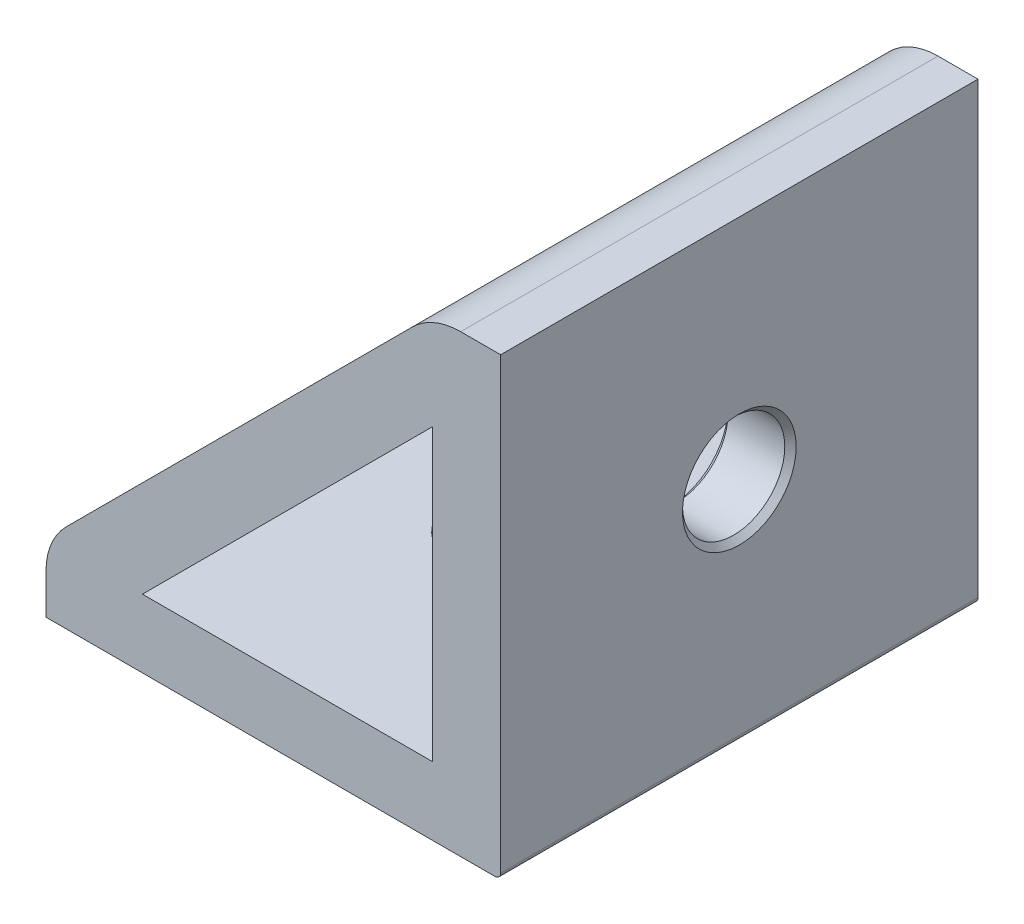
ISO-10303-21;
HEADER;
FILE_DESCRIPTION(('STEP AP214'),'2;1');
FILE_NAME('part.step','',(''),(''),'','','');
FILE_SCHEMA(('AUTOMOTIVE_DESIGN { 1 0 10303 214 1 1 1 1 }'));
ENDSEC;
DATA;
#1=APPLICATION_CONTEXT('core data for automotive mechanical design processes');
#2=APPLICATION_PROTOCOL_DEFINITION('international standard','automotive_design',2000,#1);
#3=PRODUCT_CONTEXT('',#1,'mechanical');
#4=PRODUCT('Part','Part','',(#3));
#5=PRODUCT_RELATED_PRODUCT_CATEGORY('part','',(#4));
#6=PRODUCT_DEFINITION_FORMATION('','',#4);
#7=PRODUCT_DEFINITION_CONTEXT('part definition',#1,'design');
#8=PRODUCT_DEFINITION('design','',#6,#7);
#9=PRODUCT_DEFINITION_SHAPE('','',#8);
#10=(LENGTH_UNIT() NAMED_UNIT(*) SI_UNIT(.MILLI.,.METRE.));
#11=(NAMED_UNIT(*) PLANE_ANGLE_UNIT() SI_UNIT($,.RADIAN.));
#12=(NAMED_UNIT(*) SI_UNIT($,.STERADIAN.) SOLID_ANGLE_UNIT());
#13=UNCERTAINTY_MEASURE_WITH_UNIT(LENGTH_MEASURE(1.E-05),#10,'distance_accuracy_value','');
#14=(GEOMETRIC_REPRESENTATION_CONTEXT(3) GLOBAL_UNCERTAINTY_ASSIGNED_CONTEXT((#13)) GLOBAL_UNIT_ASSIGNED_CONTEXT((#10,
#11,#12)) REPRESENTATION_CONTEXT('',''));
#15=CARTESIAN_POINT('',(0.,0.,0.));
#16=DIRECTION('',(0.,0.,1.));
#17=DIRECTION('',(1.,0.,0.));
#18=AXIS2_PLACEMENT_3D('',#15,#16,#17);
#19=CARTESIAN_POINT('',(-40.,0.,-42.));
#20=DIRECTION('',(0.,-1.,0.));
#21=DIRECTION('',(0.,0.,-1.));
#22=AXIS2_PLACEMENT_3D('',#19,#20,#21);
#23=PLANE('',#22);
#24=CARTESIAN_POINT('',(-20.,0.,-21.));
#25=DIRECTION('',(0.,-1.,0.));
#26=DIRECTION('',(0.,0.,-1.));
#27=AXIS2_PLACEMENT_3D('',#24,#25,#26);
#28=CIRCLE('',#27,5.00000000000002);
#29=CARTESIAN_POINT('',(-20.,0.,-26.));
#30=VERTEX_POINT('',#29);
#31=EDGE_CURVE('E289',#30,#30,#28,.F.);
#32=ORIENTED_EDGE('',*,*,#31,.T.);
#33=EDGE_LOOP('',(#32));
#34=FACE_BOUND('',#33,.T.);
#35=DIRECTION('',(1.,0.,0.));
#36=VECTOR('',#35,1.);
#37=CARTESIAN_POINT('',(-40.,0.,-42.));
#38=LINE('',#37,#36);
#39=CARTESIAN_POINT('',(-40.,0.,-42.));
#40=VERTEX_POINT('',#39);
#41=CARTESIAN_POINT('',(-0.500000000000007,0.,-42.));
#42=VERTEX_POINT('',#41);
#43=EDGE_CURVE('E187',#40,#42,#38,.T.);
#44=ORIENTED_EDGE('',*,*,#43,.T.);
#45=DIRECTION('',(0.,0.,1.));
#46=VECTOR('',#45,1.);
#47=CARTESIAN_POINT('',(-0.500000000000007,0.,-42.));
#48=LINE('',#47,#46);
#49=CARTESIAN_POINT('',(-0.500000000000007,0.,0.));
#50=VERTEX_POINT('',#49);
#51=EDGE_CURVE('E236',#42,#50,#48,.T.);
#52=ORIENTED_EDGE('',*,*,#51,.T.);
#53=DIRECTION('',(1.,0.,0.));
#54=VECTOR('',#53,1.);
#55=CARTESIAN_POINT('',(-40.,0.,0.));
#56=LINE('',#55,#54);
#57=CARTESIAN_POINT('',(-40.,0.,0.));
#58=VERTEX_POINT('',#57);
#59=EDGE_CURVE('E185',#58,#50,#56,.T.);
#60=ORIENTED_EDGE('',*,*,#59,.F.);
#61=DIRECTION('',(0.,0.,1.));
#62=VECTOR('',#61,1.);
#63=CARTESIAN_POINT('',(-40.,0.,-42.));
#64=LINE('',#63,#62);
#65=EDGE_CURVE('E213',#40,#58,#64,.T.);
#66=ORIENTED_EDGE('',*,*,#65,.F.);
#67=EDGE_LOOP('',(#44,#52,#60,#66));
#68=FACE_BOUND('',#67,.T.);
#69=ADVANCED_FACE('F16',(#34,#68),#23,.T.);
#70=CARTESIAN_POINT('',(-40.,0.,-42.));
#71=DIRECTION('',(-1.,0.,0.));
#72=DIRECTION('',(0.,0.,1.));
#73=AXIS2_PLACEMENT_3D('',#70,#71,#72);
#74=PLANE('',#73);
#75=DIRECTION('',(0.,-1.,0.));
#76=VECTOR('',#75,1.);
#77=CARTESIAN_POINT('',(-40.,0.,0.));
#78=LINE('',#77,#76);
#79=CARTESIAN_POINT('',(-40.,3.51471862576143,0.));
#80=VERTEX_POINT('',#79);
#81=EDGE_CURVE('E191',#80,#58,#78,.T.);
#82=ORIENTED_EDGE('',*,*,#81,.F.);
#83=DIRECTION('',(0.,0.,1.));
#84=VECTOR('',#83,1.);
#85=CARTESIAN_POINT('',(-40.,3.51471862576143,-42.));
#86=LINE('',#85,#84);
#87=CARTESIAN_POINT('',(-40.,3.51471862576143,-42.));
#88=VERTEX_POINT('',#87);
#89=EDGE_CURVE('E234',#80,#88,#86,.F.);
#90=ORIENTED_EDGE('',*,*,#89,.T.);
#91=DIRECTION('',(0.,-1.,0.));
#92=VECTOR('',#91,1.);
#93=CARTESIAN_POINT('',(-40.,0.,-42.));
#94=LINE('',#93,#92);
#95=EDGE_CURVE('E199',#88,#40,#94,.T.);
#96=ORIENTED_EDGE('',*,*,#95,.T.);
#97=ORIENTED_EDGE('',*,*,#65,.T.);
#98=EDGE_LOOP('',(#82,#90,#96,#97));
#99=FACE_BOUND('',#98,.T.);
#100=ADVANCED_FACE('F364',(#99),#74,.T.);
#101=CARTESIAN_POINT('',(-40.,6.,-42.));
#102=DIRECTION('',(-0.707106781186548,0.707106781186547,0.));
#103=DIRECTION('',(-0.707106781186547,-0.707106781186548,0.));
#104=AXIS2_PLACEMENT_3D('',#101,#102,#103);
#105=PLANE('',#104);
#106=CARTESIAN_POINT('',(-20.1715728752538,25.8284271247462,-21.));
#107=DIRECTION('',(-0.707106781186548,0.707106781186547,0.));
#108=DIRECTION('',(-0.707106781186547,-0.707106781186548,0.));
#109=AXIS2_PLACEMENT_3D('',#106,#107,#108);
#110=CIRCLE('',#109,14.);
#111=CARTESIAN_POINT('',(-20.1715728752538,25.8284271247462,-35.));
#112=VERTEX_POINT('',#111);
#113=CARTESIAN_POINT('',(-20.1715728752538,25.8284271247462,-7.00000000000001));
#114=VERTEX_POINT('',#113);
#115=EDGE_CURVE('E252',#112,#114,#110,.F.);
#116=ORIENTED_EDGE('',*,*,#115,.T.);
#117=DIRECTION('',(-0.707106781186547,-0.707106781186548,0.));
#118=VECTOR('',#117,1.);
#119=CARTESIAN_POINT('',(-25.8284271247462,20.1715728752538,-7.));
#120=LINE('',#119,#118);
#121=CARTESIAN_POINT('',(-25.8284271247462,20.1715728752538,-7.00000000000001));
#122=VERTEX_POINT('',#121);
#123=EDGE_CURVE('E254',#114,#122,#120,.T.);
#124=ORIENTED_EDGE('',*,*,#123,.T.);
#125=CARTESIAN_POINT('',(-25.8284271247462,20.1715728752538,-21.));
#126=DIRECTION('',(-0.707106781186548,0.707106781186547,0.));
#127=DIRECTION('',(-0.707106781186547,-0.707106781186548,0.));
#128=AXIS2_PLACEMENT_3D('',#125,#126,#127);
#129=CIRCLE('',#128,14.);
#130=CARTESIAN_POINT('',(-25.8284271247462,20.1715728752538,-35.));
#131=VERTEX_POINT('',#130);
#132=EDGE_CURVE('E250',#122,#131,#129,.F.);
#133=ORIENTED_EDGE('',*,*,#132,.T.);
#134=DIRECTION('',(0.707106781186547,0.707106781186548,0.));
#135=VECTOR('',#134,1.);
#136=CARTESIAN_POINT('',(-20.1715728752538,25.8284271247462,-35.));
#137=LINE('',#136,#135);
#138=EDGE_CURVE('E248',#131,#112,#137,.T.);
#139=ORIENTED_EDGE('',*,*,#138,.T.);
#140=EDGE_LOOP('',(#116,#124,#133,#139));
#141=FACE_BOUND('',#140,.T.);
#142=DIRECTION('',(-0.707106781186547,-0.707106781186548,0.));
#143=VECTOR('',#142,1.);
#144=CARTESIAN_POINT('',(-40.,6.,0.));
#145=LINE('',#144,#143);
#146=CARTESIAN_POINT('',(-7.75735931288071,38.2426406871193,0.));
#147=VERTEX_POINT('',#146);
#148=CARTESIAN_POINT('',(-38.2426406871193,7.75735931288071,0.));
#149=VERTEX_POINT('',#148);
#150=EDGE_CURVE('E209',#147,#149,#145,.T.);
#151=ORIENTED_EDGE('',*,*,#150,.F.);
#152=DIRECTION('',(0.,0.,1.));
#153=VECTOR('',#152,1.);
#154=CARTESIAN_POINT('',(-7.75735931288071,38.2426406871193,-42.));
#155=LINE('',#154,#153);
#156=CARTESIAN_POINT('',(-7.75735931288071,38.2426406871193,-42.));
#157=VERTEX_POINT('',#156);
#158=EDGE_CURVE('E228',#147,#157,#155,.F.);
#159=ORIENTED_EDGE('',*,*,#158,.T.);
#160=DIRECTION('',(-0.707106781186547,-0.707106781186548,0.));
#161=VECTOR('',#160,1.);
#162=CARTESIAN_POINT('',(-40.,6.,-42.));
#163=LINE('',#162,#161);
#164=CARTESIAN_POINT('',(-38.2426406871193,7.75735931288071,-42.));
#165=VERTEX_POINT('',#164);
#166=EDGE_CURVE('E196',#157,#165,#163,.T.);
#167=ORIENTED_EDGE('',*,*,#166,.T.);
#168=DIRECTION('',(0.,0.,1.));
#169=VECTOR('',#168,1.);
#170=CARTESIAN_POINT('',(-38.2426406871193,7.75735931288071,-42.));
#171=LINE('',#170,#169);
#172=EDGE_CURVE('E225',#165,#149,#171,.T.);
#173=ORIENTED_EDGE('',*,*,#172,.T.);
#174=EDGE_LOOP('',(#151,#159,#167,#173));
#175=FACE_BOUND('',#174,.T.);
#176=ADVANCED_FACE('F370',(#141,#175),#105,.T.);
#177=CARTESIAN_POINT('',(0.,40.,-42.));
#178=DIRECTION('',(0.,1.,0.));
#179=DIRECTION('',(0.,0.,1.));
#180=AXIS2_PLACEMENT_3D('',#177,#178,#179);
#181=PLANE('',#180);
#182=DIRECTION('',(-1.,0.,0.));
#183=VECTOR('',#182,1.);
#184=CARTESIAN_POINT('',(0.,40.,-42.));
#185=LINE('',#184,#183);
#186=CARTESIAN_POINT('',(0.,40.,-42.));
#187=VERTEX_POINT('',#186);
#188=CARTESIAN_POINT('',(-3.51471862576143,40.,-42.));
#189=VERTEX_POINT('',#188);
#190=EDGE_CURVE('E193',#187,#189,#185,.T.);
#191=ORIENTED_EDGE('',*,*,#190,.T.);
#192=DIRECTION('',(0.,0.,1.));
#193=VECTOR('',#192,1.);
#194=CARTESIAN_POINT('',(-3.51471862576143,40.,-42.));
#195=LINE('',#194,#193);
#196=CARTESIAN_POINT('',(-3.51471862576143,40.,0.));
#197=VERTEX_POINT('',#196);
#198=EDGE_CURVE('E216',#189,#197,#195,.T.);
#199=ORIENTED_EDGE('',*,*,#198,.T.);
#200=DIRECTION('',(-1.,0.,0.));
#201=VECTOR('',#200,1.);
#202=CARTESIAN_POINT('',(0.,40.,0.));
#203=LINE('',#202,#201);
#204=CARTESIAN_POINT('',(0.,40.,0.));
#205=VERTEX_POINT('',#204);
#206=EDGE_CURVE('E206',#205,#197,#203,.T.);
#207=ORIENTED_EDGE('',*,*,#206,.F.);
#208=DIRECTION('',(0.,0.,1.));
#209=VECTOR('',#208,1.);
#210=CARTESIAN_POINT('',(0.,40.,-42.));
#211=LINE('',#210,#209);
#212=EDGE_CURVE('E201',#187,#205,#211,.T.);
#213=ORIENTED_EDGE('',*,*,#212,.F.);
#214=EDGE_LOOP('',(#191,#199,#207,#213));
#215=FACE_BOUND('',#214,.T.);
#216=ADVANCED_FACE('F614',(#215),#181,.T.);
#217=CARTESIAN_POINT('',(0.,0.,-42.));
#218=DIRECTION('',(1.,0.,0.));
#219=DIRECTION('',(0.,0.,-1.));
#220=AXIS2_PLACEMENT_3D('',#217,#218,#219);
#221=PLANE('',#220);
#222=CARTESIAN_POINT('',(0.,20.,-21.));
#223=DIRECTION('',(1.,0.,0.));
#224=DIRECTION('',(0.,0.,-1.));
#225=AXIS2_PLACEMENT_3D('',#222,#223,#224);
#226=CIRCLE('',#225,4.99999999999999);
#227=CARTESIAN_POINT('',(0.,20.,-26.));
#228=VERTEX_POINT('',#227);
#229=EDGE_CURVE('E283',#228,#228,#226,.F.);
#230=ORIENTED_EDGE('',*,*,#229,.T.);
#231=EDGE_LOOP('',(#230));
#232=FACE_BOUND('',#231,.T.);
#233=DIRECTION('',(0.,1.,0.));
#234=VECTOR('',#233,1.);
#235=CARTESIAN_POINT('',(0.,0.,0.));
#236=LINE('',#235,#234);
#237=CARTESIAN_POINT('',(0.,0.5,0.));
#238=VERTEX_POINT('',#237);
#239=EDGE_CURVE('E204',#238,#205,#236,.T.);
#240=ORIENTED_EDGE('',*,*,#239,.F.);
#241=DIRECTION('',(0.,0.,1.));
#242=VECTOR('',#241,1.);
#243=CARTESIAN_POINT('',(0.,0.5,-42.));
#244=LINE('',#243,#242);
#245=CARTESIAN_POINT('',(0.,0.5,-42.));
#246=VERTEX_POINT('',#245);
#247=EDGE_CURVE('E241',#238,#246,#244,.F.);
#248=ORIENTED_EDGE('',*,*,#247,.T.);
#249=DIRECTION('',(0.,1.,0.));
#250=VECTOR('',#249,1.);
#251=CARTESIAN_POINT('',(0.,0.,-42.));
#252=LINE('',#251,#250);
#253=EDGE_CURVE('E190',#246,#187,#252,.T.);
#254=ORIENTED_EDGE('',*,*,#253,.T.);
#255=ORIENTED_EDGE('',*,*,#212,.T.);
#256=EDGE_LOOP('',(#240,#248,#254,#255));
#257=FACE_BOUND('',#256,.T.);
#258=ADVANCED_FACE('F376',(#232,#257),#221,.T.);
#259=CARTESIAN_POINT('',(0.,0.,-42.));
#260=DIRECTION('',(0.,0.,1.));
#261=DIRECTION('',(1.,0.,0.));
#262=AXIS2_PLACEMENT_3D('',#259,#260,#261);
#263=PLANE('',#262);
#264=DIRECTION('',(0.,1.,0.));
#265=VECTOR('',#264,1.);
#266=CARTESIAN_POINT('',(-6.,6.,-42.));
#267=LINE('',#266,#265);
#268=CARTESIAN_POINT('',(-6.,6.,-42.));
#269=VERTEX_POINT('',#268);
#270=CARTESIAN_POINT('',(-6.,31.5147186257614,-42.));
#271=VERTEX_POINT('',#270);
#272=EDGE_CURVE('E160',#269,#271,#267,.T.);
#273=ORIENTED_EDGE('',*,*,#272,.T.);
#274=DIRECTION('',(-0.707106781186547,-0.707106781186548,0.));
#275=VECTOR('',#274,1.);
#276=CARTESIAN_POINT('',(-6.,31.5147186257614,-42.));
#277=LINE('',#276,#275);
#278=CARTESIAN_POINT('',(-31.5147186257614,6.,-42.));
#279=VERTEX_POINT('',#278);
#280=EDGE_CURVE('E152',#271,#279,#277,.T.);
#281=ORIENTED_EDGE('',*,*,#280,.T.);
#282=DIRECTION('',(1.,0.,0.));
#283=VECTOR('',#282,1.);
#284=CARTESIAN_POINT('',(-31.5147186257614,6.,-42.));
#285=LINE('',#284,#283);
#286=EDGE_CURVE('E164',#279,#269,#285,.T.);
#287=ORIENTED_EDGE('',*,*,#286,.T.);
#288=EDGE_LOOP('',(#273,#281,#287));
#289=FACE_BOUND('',#288,.T.);
#290=ORIENTED_EDGE('',*,*,#253,.F.);
#291=CARTESIAN_POINT('',(-0.500000000000007,0.5,-42.));
#292=DIRECTION('',(0.,0.,1.));
#293=DIRECTION('',(1.,0.,0.));
#294=AXIS2_PLACEMENT_3D('',#291,#292,#293);
#295=CIRCLE('',#294,0.5);
#296=EDGE_CURVE('E243',#246,#42,#295,.F.);
#297=ORIENTED_EDGE('',*,*,#296,.T.);
#298=ORIENTED_EDGE('',*,*,#43,.F.);
#299=ORIENTED_EDGE('',*,*,#95,.F.);
#300=CARTESIAN_POINT('',(-34.,3.51471862576143,-42.));
#301=DIRECTION('',(0.,0.,1.));
#302=DIRECTION('',(1.,0.,0.));
#303=AXIS2_PLACEMENT_3D('',#300,#301,#302);
#304=CIRCLE('',#303,6.);
#305=EDGE_CURVE('E230',#88,#165,#304,.F.);
#306=ORIENTED_EDGE('',*,*,#305,.T.);
#307=ORIENTED_EDGE('',*,*,#166,.F.);
#308=CARTESIAN_POINT('',(-3.51471862576143,34.,-42.));
#309=DIRECTION('',(0.,0.,1.));
#310=DIRECTION('',(1.,0.,0.));
#311=AXIS2_PLACEMENT_3D('',#308,#309,#310);
#312=CIRCLE('',#311,6.);
#313=EDGE_CURVE('E232',#157,#189,#312,.F.);
#314=ORIENTED_EDGE('',*,*,#313,.T.);
#315=ORIENTED_EDGE('',*,*,#190,.F.);
#316=EDGE_LOOP('',(#290,#297,#298,#299,#306,#307,#314,#315));
#317=FACE_BOUND('',#316,.T.);
#318=ADVANCED_FACE('F168',(#289,#317),#263,.F.);
#319=CARTESIAN_POINT('',(0.,0.,0.));
#320=DIRECTION('',(0.,0.,1.));
#321=DIRECTION('',(1.,0.,0.));
#322=AXIS2_PLACEMENT_3D('',#319,#320,#321);
#323=PLANE('',#322);
#324=DIRECTION('',(-0.707106781186547,-0.707106781186548,0.));
#325=VECTOR('',#324,1.);
#326=CARTESIAN_POINT('',(-6.,31.5147186257614,0.));
#327=LINE('',#326,#325);
#328=CARTESIAN_POINT('',(-6.,31.5147186257614,0.));
#329=VERTEX_POINT('',#328);
#330=CARTESIAN_POINT('',(-31.5147186257614,6.,0.));
#331=VERTEX_POINT('',#330);
#332=EDGE_CURVE('E155',#329,#331,#327,.T.);
#333=ORIENTED_EDGE('',*,*,#332,.F.);
#334=DIRECTION('',(0.,1.,0.));
#335=VECTOR('',#334,1.);
#336=CARTESIAN_POINT('',(-6.,6.,0.));
#337=LINE('',#336,#335);
#338=CARTESIAN_POINT('',(-6.,6.,0.));
#339=VERTEX_POINT('',#338);
#340=EDGE_CURVE('E170',#339,#329,#337,.T.);
#341=ORIENTED_EDGE('',*,*,#340,.F.);
#342=DIRECTION('',(1.,0.,0.));
#343=VECTOR('',#342,1.);
#344=CARTESIAN_POINT('',(-31.5147186257614,6.,0.));
#345=LINE('',#344,#343);
#346=EDGE_CURVE('E173',#331,#339,#345,.T.);
#347=ORIENTED_EDGE('',*,*,#346,.F.);
#348=EDGE_LOOP('',(#333,#341,#347));
#349=FACE_BOUND('',#348,.T.);
#350=ORIENTED_EDGE('',*,*,#59,.T.);
#351=CARTESIAN_POINT('',(-0.500000000000007,0.5,0.));
#352=DIRECTION('',(0.,0.,1.));
#353=DIRECTION('',(1.,0.,0.));
#354=AXIS2_PLACEMENT_3D('',#351,#352,#353);
#355=CIRCLE('',#354,0.5);
#356=EDGE_CURVE('E239',#50,#238,#355,.T.);
#357=ORIENTED_EDGE('',*,*,#356,.T.);
#358=ORIENTED_EDGE('',*,*,#239,.T.);
#359=ORIENTED_EDGE('',*,*,#206,.T.);
#360=CARTESIAN_POINT('',(-3.51471862576143,34.,0.));
#361=DIRECTION('',(0.,0.,1.));
#362=DIRECTION('',(1.,0.,0.));
#363=AXIS2_PLACEMENT_3D('',#360,#361,#362);
#364=CIRCLE('',#363,6.);
#365=EDGE_CURVE('E223',#197,#147,#364,.T.);
#366=ORIENTED_EDGE('',*,*,#365,.T.);
#367=ORIENTED_EDGE('',*,*,#150,.T.);
#368=CARTESIAN_POINT('',(-34.,3.51471862576143,0.));
#369=DIRECTION('',(0.,0.,1.));
#370=DIRECTION('',(1.,0.,0.));
#371=AXIS2_PLACEMENT_3D('',#368,#369,#370);
#372=CIRCLE('',#371,6.);
#373=EDGE_CURVE('E221',#149,#80,#372,.T.);
#374=ORIENTED_EDGE('',*,*,#373,.T.);
#375=ORIENTED_EDGE('',*,*,#81,.T.);
#376=EDGE_LOOP('',(#350,#357,#358,#359,#366,#367,#374,#375));
#377=FACE_BOUND('',#376,.T.);
#378=ADVANCED_FACE('F350',(#349,#377),#323,.T.);
#379=CARTESIAN_POINT('',(-6.,31.5147186257614,-42.));
#380=DIRECTION('',(-0.707106781186548,0.707106781186547,0.));
#381=DIRECTION('',(-0.707106781186547,-0.707106781186548,0.));
#382=AXIS2_PLACEMENT_3D('',#379,#380,#381);
#383=PLANE('',#382);
#384=DIRECTION('',(0.707106781186547,0.707106781186548,0.));
#385=VECTOR('',#384,1.);
#386=CARTESIAN_POINT('',(-6.,31.5147186257614,-10.5));
#387=LINE('',#386,#385);
#388=CARTESIAN_POINT('',(-21.5857864376269,15.9289321881345,-10.5));
#389=VERTEX_POINT('',#388);
#390=CARTESIAN_POINT('',(-15.9289321881345,21.5857864376269,-10.5));
#391=VERTEX_POINT('',#390);
#392=EDGE_CURVE('E303',#389,#391,#387,.T.);
#393=ORIENTED_EDGE('',*,*,#392,.T.);
#394=CARTESIAN_POINT('',(-15.9289321881345,21.5857864376269,-21.));
#395=DIRECTION('',(-0.707106781186548,0.707106781186547,0.));
#396=DIRECTION('',(-0.707106781186547,-0.707106781186548,0.));
#397=AXIS2_PLACEMENT_3D('',#394,#395,#396);
#398=CIRCLE('',#397,10.5);
#399=CARTESIAN_POINT('',(-15.9289321881345,21.5857864376269,-31.5));
#400=VERTEX_POINT('',#399);
#401=EDGE_CURVE('E307',#391,#400,#398,.T.);
#402=ORIENTED_EDGE('',*,*,#401,.T.);
#403=DIRECTION('',(-0.707106781186547,-0.707106781186548,0.));
#404=VECTOR('',#403,1.);
#405=CARTESIAN_POINT('',(-6.,31.5147186257614,-31.5));
#406=LINE('',#405,#404);
#407=CARTESIAN_POINT('',(-21.5857864376269,15.9289321881345,-31.5));
#408=VERTEX_POINT('',#407);
#409=EDGE_CURVE('E305',#400,#408,#406,.T.);
#410=ORIENTED_EDGE('',*,*,#409,.T.);
#411=CARTESIAN_POINT('',(-21.5857864376269,15.9289321881345,-21.));
#412=DIRECTION('',(-0.707106781186548,0.707106781186547,0.));
#413=DIRECTION('',(-0.707106781186547,-0.707106781186548,0.));
#414=AXIS2_PLACEMENT_3D('',#411,#412,#413);
#415=CIRCLE('',#414,10.5);
#416=EDGE_CURVE('E301',#408,#389,#415,.T.);
#417=ORIENTED_EDGE('',*,*,#416,.T.);
#418=EDGE_LOOP('',(#393,#402,#410,#417));
#419=FACE_BOUND('',#418,.T.);
#420=ORIENTED_EDGE('',*,*,#332,.T.);
#421=DIRECTION('',(0.,0.,1.));
#422=VECTOR('',#421,1.);
#423=CARTESIAN_POINT('',(-31.5147186257614,6.,-42.));
#424=LINE('',#423,#422);
#425=EDGE_CURVE('E148',#279,#331,#424,.T.);
#426=ORIENTED_EDGE('',*,*,#425,.F.);
#427=ORIENTED_EDGE('',*,*,#280,.F.);
#428=DIRECTION('',(0.,0.,1.));
#429=VECTOR('',#428,1.);
#430=CARTESIAN_POINT('',(-6.,31.5147186257614,-42.));
#431=LINE('',#430,#429);
#432=EDGE_CURVE('E183',#271,#329,#431,.T.);
#433=ORIENTED_EDGE('',*,*,#432,.T.);
#434=EDGE_LOOP('',(#420,#426,#427,#433));
#435=FACE_BOUND('',#434,.T.);
#436=ADVANCED_FACE('F150',(#419,#435),#383,.F.);
#437=CARTESIAN_POINT('',(-6.,6.,-42.));
#438=DIRECTION('',(1.,0.,0.));
#439=DIRECTION('',(0.,1.,0.));
#440=AXIS2_PLACEMENT_3D('',#437,#438,#439);
#441=PLANE('',#440);
#442=CARTESIAN_POINT('',(-6.,20.,-21.));
#443=DIRECTION('',(1.,0.,0.));
#444=DIRECTION('',(0.,1.,0.));
#445=AXIS2_PLACEMENT_3D('',#442,#443,#444);
#446=CIRCLE('',#445,5.00000000000002);
#447=CARTESIAN_POINT('',(-6.,25.,-21.));
#448=VERTEX_POINT('',#447);
#449=EDGE_CURVE('E286',#448,#448,#446,.T.);
#450=ORIENTED_EDGE('',*,*,#449,.T.);
#451=EDGE_LOOP('',(#450));
#452=FACE_BOUND('',#451,.T.);
#453=ORIENTED_EDGE('',*,*,#340,.T.);
#454=ORIENTED_EDGE('',*,*,#432,.F.);
#455=ORIENTED_EDGE('',*,*,#272,.F.);
#456=DIRECTION('',(0.,0.,1.));
#457=VECTOR('',#456,1.);
#458=CARTESIAN_POINT('',(-6.,6.,-42.));
#459=LINE('',#458,#457);
#460=EDGE_CURVE('E159',#269,#339,#459,.T.);
#461=ORIENTED_EDGE('',*,*,#460,.T.);
#462=EDGE_LOOP('',(#453,#454,#455,#461));
#463=FACE_BOUND('',#462,.T.);
#464=ADVANCED_FACE('F349',(#452,#463),#441,.F.);
#465=CARTESIAN_POINT('',(-31.5147186257614,6.,-42.));
#466=DIRECTION('',(0.,-1.,0.));
#467=DIRECTION('',(1.,0.,0.));
#468=AXIS2_PLACEMENT_3D('',#465,#466,#467);
#469=PLANE('',#468);
#470=CARTESIAN_POINT('',(-20.,6.,-21.));
#471=DIRECTION('',(0.,-1.,0.));
#472=DIRECTION('',(1.,0.,0.));
#473=AXIS2_PLACEMENT_3D('',#470,#471,#472);
#474=CIRCLE('',#473,5.);
#475=CARTESIAN_POINT('',(-15.,6.,-21.));
#476=VERTEX_POINT('',#475);
#477=EDGE_CURVE('E298',#476,#476,#474,.T.);
#478=ORIENTED_EDGE('',*,*,#477,.T.);
#479=EDGE_LOOP('',(#478));
#480=FACE_BOUND('',#479,.T.);
#481=ORIENTED_EDGE('',*,*,#346,.T.);
#482=ORIENTED_EDGE('',*,*,#460,.F.);
#483=ORIENTED_EDGE('',*,*,#286,.F.);
#484=ORIENTED_EDGE('',*,*,#425,.T.);
#485=EDGE_LOOP('',(#481,#482,#483,#484));
#486=FACE_BOUND('',#485,.T.);
#487=ADVANCED_FACE('F165',(#480,#486),#469,.F.);
#488=CARTESIAN_POINT('',(-6.,20.,-21.));
#489=DIRECTION('',(1.,0.,0.));
#490=DIRECTION('',(0.,0.,-1.));
#491=AXIS2_PLACEMENT_3D('',#488,#489,#490);
#492=CYLINDRICAL_SURFACE('',#491,4.5);
#493=CARTESIAN_POINT('',(-0.499999999999991,20.,-21.));
#494=DIRECTION('',(1.,0.,0.));
#495=DIRECTION('',(0.,0.,-1.));
#496=AXIS2_PLACEMENT_3D('',#493,#494,#495);
#497=CIRCLE('',#496,4.5);
#498=CARTESIAN_POINT('',(-0.499999999999991,20.,-25.5));
#499=VERTEX_POINT('',#498);
#500=EDGE_CURVE('E280',#499,#499,#497,.T.);
#501=ORIENTED_EDGE('',*,*,#500,.T.);
#502=EDGE_LOOP('',(#501));
#503=FACE_BOUND('',#502,.T.);
#504=CARTESIAN_POINT('',(-5.49999999999998,20.,-21.));
#505=DIRECTION('',(1.,0.,0.));
#506=DIRECTION('',(0.,0.,-1.));
#507=AXIS2_PLACEMENT_3D('',#504,#505,#506);
#508=CIRCLE('',#507,4.5);
#509=CARTESIAN_POINT('',(-5.49999999999998,20.,-25.5));
#510=VERTEX_POINT('',#509);
#511=EDGE_CURVE('E266',#510,#510,#508,.F.);
#512=ORIENTED_EDGE('',*,*,#511,.T.);
#513=EDGE_LOOP('',(#512));
#514=FACE_BOUND('',#513,.T.);
#515=ADVANCED_FACE('F560',(#503,#514),#492,.F.);
#516=CARTESIAN_POINT('',(-20.,5.99999999999999,-21.));
#517=DIRECTION('',(0.,-1.,0.));
#518=DIRECTION('',(1.,0.,0.));
#519=AXIS2_PLACEMENT_3D('',#516,#517,#518);
#520=CYLINDRICAL_SURFACE('',#519,4.5);
#521=CARTESIAN_POINT('',(-20.,0.500000000000013,-21.));
#522=DIRECTION('',(0.,-1.,0.));
#523=DIRECTION('',(0.,0.,-1.));
#524=AXIS2_PLACEMENT_3D('',#521,#522,#523);
#525=CIRCLE('',#524,4.5);
#526=CARTESIAN_POINT('',(-20.,0.500000000000013,-25.5));
#527=VERTEX_POINT('',#526);
#528=EDGE_CURVE('E295',#527,#527,#525,.T.);
#529=ORIENTED_EDGE('',*,*,#528,.T.);
#530=EDGE_LOOP('',(#529));
#531=FACE_BOUND('',#530,.T.);
#532=CARTESIAN_POINT('',(-20.,5.5,-21.));
#533=DIRECTION('',(0.,-1.,0.));
#534=DIRECTION('',(0.,0.,-1.));
#535=AXIS2_PLACEMENT_3D('',#532,#533,#534);
#536=CIRCLE('',#535,4.5);
#537=CARTESIAN_POINT('',(-20.,5.5,-25.5));
#538=VERTEX_POINT('',#537);
#539=EDGE_CURVE('E292',#538,#538,#536,.F.);
#540=ORIENTED_EDGE('',*,*,#539,.T.);
#541=EDGE_LOOP('',(#540));
#542=FACE_BOUND('',#541,.T.);
#543=ADVANCED_FACE('F552',(#531,#542),#520,.F.);
#544=CARTESIAN_POINT('',(-15.9289321881345,21.5857864376269,-21.));
#545=DIRECTION('',(-0.707106781186547,0.707106781186547,0.));
#546=DIRECTION('',(-0.707106781186548,-0.707106781186548,0.));
#547=AXIS2_PLACEMENT_3D('',#544,#545,#546);
#548=CYLINDRICAL_SURFACE('',#547,10.);
#549=DIRECTION('',(-0.707106781186547,0.707106781186547,0.));
#550=VECTOR('',#549,1.);
#551=CARTESIAN_POINT('',(-15.9289321881345,21.5857864376269,-31.));
#552=LINE('',#551,#550);
#553=CARTESIAN_POINT('',(-16.2824855787278,21.9393398282202,-31.));
#554=VERTEX_POINT('',#553);
#555=CARTESIAN_POINT('',(-17.3431457505076,23.,-31.));
#556=VERTEX_POINT('',#555);
#557=EDGE_CURVE('E176',#554,#556,#552,.T.);
#558=ORIENTED_EDGE('',*,*,#557,.F.);
#559=CARTESIAN_POINT('',(-16.2824855787278,21.9393398282202,-21.));
#560=DIRECTION('',(-0.707106781186547,0.707106781186547,0.));
#561=DIRECTION('',(-0.707106781186548,-0.707106781186548,0.));
#562=AXIS2_PLACEMENT_3D('',#559,#560,#561);
#563=CIRCLE('',#562,10.);
#564=CARTESIAN_POINT('',(-16.2824855787278,21.9393398282202,-11.));
#565=VERTEX_POINT('',#564);
#566=EDGE_CURVE('E310',#554,#565,#563,.F.);
#567=ORIENTED_EDGE('',*,*,#566,.T.);
#568=DIRECTION('',(-0.707106781186547,0.707106781186547,0.));
#569=VECTOR('',#568,1.);
#570=CARTESIAN_POINT('',(-15.9289321881345,21.5857864376269,-11.));
#571=LINE('',#570,#569);
#572=CARTESIAN_POINT('',(-17.3431457505076,23.,-11.));
#573=VERTEX_POINT('',#572);
#574=EDGE_CURVE('E181',#565,#573,#571,.T.);
#575=ORIENTED_EDGE('',*,*,#574,.T.);
#576=CARTESIAN_POINT('',(-17.3431457505076,23.,-21.));
#577=DIRECTION('',(-0.707106781186547,0.707106781186547,0.));
#578=DIRECTION('',(-0.707106781186548,-0.707106781186548,0.));
#579=AXIS2_PLACEMENT_3D('',#576,#577,#578);
#580=CIRCLE('',#579,10.);
#581=EDGE_CURVE('E257',#573,#556,#580,.T.);
#582=ORIENTED_EDGE('',*,*,#581,.T.);
#583=EDGE_LOOP('',(#558,#567,#575,#582));
#584=FACE_BOUND('',#583,.T.);
#585=ADVANCED_FACE('F341',(#584),#548,.F.);
#586=CARTESIAN_POINT('',(-15.9289321881345,21.5857864376269,-11.));
#587=DIRECTION('',(0.,0.,1.));
#588=DIRECTION('',(1.,0.,0.));
#589=AXIS2_PLACEMENT_3D('',#586,#587,#588);
#590=PLANE('',#589);
#591=ORIENTED_EDGE('',*,*,#574,.F.);
#592=DIRECTION('',(-0.707106781186547,-0.707106781186548,0.));
#593=VECTOR('',#592,1.);
#594=CARTESIAN_POINT('',(-16.2824855787278,21.9393398282202,-11.));
#595=LINE('',#594,#593);
#596=CARTESIAN_POINT('',(-21.9393398282202,16.2824855787278,-11.));
#597=VERTEX_POINT('',#596);
#598=EDGE_CURVE('E26',#565,#597,#595,.T.);
#599=ORIENTED_EDGE('',*,*,#598,.T.);
#600=DIRECTION('',(-0.707106781186547,0.707106781186547,0.));
#601=VECTOR('',#600,1.);
#602=CARTESIAN_POINT('',(-21.5857864376269,15.9289321881345,-11.));
#603=LINE('',#602,#601);
#604=CARTESIAN_POINT('',(-23.,17.3431457505076,-11.));
#605=VERTEX_POINT('',#604);
#606=EDGE_CURVE('E711',#597,#605,#603,.T.);
#607=ORIENTED_EDGE('',*,*,#606,.T.);
#608=DIRECTION('',(0.707106781186547,0.707106781186548,0.));
#609=VECTOR('',#608,1.);
#610=CARTESIAN_POINT('',(-17.3431457505076,23.,-11.));
#611=LINE('',#610,#609);
#612=EDGE_CURVE('E245',#605,#573,#611,.T.);
#613=ORIENTED_EDGE('',*,*,#612,.T.);
#614=EDGE_LOOP('',(#591,#599,#607,#613));
#615=FACE_BOUND('',#614,.T.);
#616=ADVANCED_FACE('F537',(#615),#590,.F.);
#617=CARTESIAN_POINT('',(-21.5857864376269,15.9289321881345,-21.));
#618=DIRECTION('',(-0.707106781186547,0.707106781186547,0.));
#619=DIRECTION('',(-0.707106781186548,-0.707106781186548,0.));
#620=AXIS2_PLACEMENT_3D('',#617,#618,#619);
#621=CYLINDRICAL_SURFACE('',#620,10.);
#622=ORIENTED_EDGE('',*,*,#606,.F.);
#623=CARTESIAN_POINT('',(-21.9393398282202,16.2824855787278,-21.));
#624=DIRECTION('',(-0.707106781186548,0.707106781186548,0.));
#625=DIRECTION('',(-0.707106781186548,-0.707106781186548,0.));
#626=AXIS2_PLACEMENT_3D('',#623,#624,#625);
#627=CIRCLE('',#626,10.);
#628=CARTESIAN_POINT('',(-21.9393398282202,16.2824855787278,-31.));
#629=VERTEX_POINT('',#628);
#630=EDGE_CURVE('E10',#597,#629,#627,.F.);
#631=ORIENTED_EDGE('',*,*,#630,.T.);
#632=DIRECTION('',(-0.707106781186547,0.707106781186547,0.));
#633=VECTOR('',#632,1.);
#634=CARTESIAN_POINT('',(-21.5857864376269,15.9289321881345,-31.));
#635=LINE('',#634,#633);
#636=CARTESIAN_POINT('',(-23.,17.3431457505076,-31.));
#637=VERTEX_POINT('',#636);
#638=EDGE_CURVE('E338',#629,#637,#635,.T.);
#639=ORIENTED_EDGE('',*,*,#638,.T.);
#640=CARTESIAN_POINT('',(-23.,17.3431457505076,-21.));
#641=DIRECTION('',(-0.707106781186547,0.707106781186547,0.));
#642=DIRECTION('',(-0.707106781186548,-0.707106781186548,0.));
#643=AXIS2_PLACEMENT_3D('',#640,#641,#642);
#644=CIRCLE('',#643,10.);
#645=EDGE_CURVE('E260',#637,#605,#644,.T.);
#646=ORIENTED_EDGE('',*,*,#645,.T.);
#647=EDGE_LOOP('',(#622,#631,#639,#646));
#648=FACE_BOUND('',#647,.T.);
#649=ADVANCED_FACE('F529',(#648),#621,.F.);
#650=CARTESIAN_POINT('',(-15.9289321881345,21.5857864376269,-31.));
#651=DIRECTION('',(0.,0.,-1.));
#652=DIRECTION('',(-1.,0.,0.));
#653=AXIS2_PLACEMENT_3D('',#650,#651,#652);
#654=PLANE('',#653);
#655=ORIENTED_EDGE('',*,*,#638,.F.);
#656=DIRECTION('',(0.707106781186547,0.707106781186548,0.));
#657=VECTOR('',#656,1.);
#658=CARTESIAN_POINT('',(-16.2824855787278,21.9393398282202,-31.));
#659=LINE('',#658,#657);
#660=EDGE_CURVE('E313',#629,#554,#659,.T.);
#661=ORIENTED_EDGE('',*,*,#660,.T.);
#662=ORIENTED_EDGE('',*,*,#557,.T.);
#663=DIRECTION('',(-0.707106781186547,-0.707106781186548,0.));
#664=VECTOR('',#663,1.);
#665=CARTESIAN_POINT('',(-23.,17.3431457505076,-31.));
#666=LINE('',#665,#664);
#667=EDGE_CURVE('E263',#556,#637,#666,.T.);
#668=ORIENTED_EDGE('',*,*,#667,.T.);
#669=EDGE_LOOP('',(#655,#661,#662,#668));
#670=FACE_BOUND('',#669,.T.);
#671=ADVANCED_FACE('F337',(#670),#654,.F.);
#672=CARTESIAN_POINT('',(-3.51471862576143,34.,-42.));
#673=DIRECTION('',(0.,0.,1.));
#674=DIRECTION('',(1.,0.,0.));
#675=AXIS2_PLACEMENT_3D('',#672,#673,#674);
#676=CYLINDRICAL_SURFACE('',#675,6.);
#677=ORIENTED_EDGE('',*,*,#313,.F.);
#678=ORIENTED_EDGE('',*,*,#158,.F.);
#679=ORIENTED_EDGE('',*,*,#365,.F.);
#680=ORIENTED_EDGE('',*,*,#198,.F.);
#681=EDGE_LOOP('',(#677,#678,#679,#680));
#682=FACE_BOUND('',#681,.T.);
#683=ADVANCED_FACE('F378',(#682),#676,.T.);
#684=CARTESIAN_POINT('',(-34.,3.51471862576143,-42.));
#685=DIRECTION('',(0.,0.,1.));
#686=DIRECTION('',(1.,0.,0.));
#687=AXIS2_PLACEMENT_3D('',#684,#685,#686);
#688=CYLINDRICAL_SURFACE('',#687,6.);
#689=ORIENTED_EDGE('',*,*,#305,.F.);
#690=ORIENTED_EDGE('',*,*,#89,.F.);
#691=ORIENTED_EDGE('',*,*,#373,.F.);
#692=ORIENTED_EDGE('',*,*,#172,.F.);
#693=EDGE_LOOP('',(#689,#690,#691,#692));
#694=FACE_BOUND('',#693,.T.);
#695=ADVANCED_FACE('F381',(#694),#688,.T.);
#696=CARTESIAN_POINT('',(-0.500000000000007,0.5,-42.));
#697=DIRECTION('',(0.,0.,1.));
#698=DIRECTION('',(1.,0.,0.));
#699=AXIS2_PLACEMENT_3D('',#696,#697,#698);
#700=CYLINDRICAL_SURFACE('',#699,0.5);
#701=ORIENTED_EDGE('',*,*,#296,.F.);
#702=ORIENTED_EDGE('',*,*,#247,.F.);
#703=ORIENTED_EDGE('',*,*,#356,.F.);
#704=ORIENTED_EDGE('',*,*,#51,.F.);
#705=EDGE_LOOP('',(#701,#702,#703,#704));
#706=FACE_BOUND('',#705,.T.);
#707=ADVANCED_FACE('F385',(#706),#700,.T.);
#708=CARTESIAN_POINT('',(-17.3431457505076,23.,-31.));
#709=DIRECTION('',(-0.500000000000001,0.5,0.707106781186547));
#710=DIRECTION('',(0.707106781186547,0.707106781186548,0.));
#711=AXIS2_PLACEMENT_3D('',#708,#709,#710);
#712=PLANE('',#711);
#713=DIRECTION('',(0.5,-0.5,0.707106781186548));
#714=VECTOR('',#713,1.);
#715=CARTESIAN_POINT('',(-20.1715728752538,25.8284271247462,-35.));
#716=LINE('',#715,#714);
#717=EDGE_CURVE('E272',#112,#556,#716,.T.);
#718=ORIENTED_EDGE('',*,*,#717,.F.);
#719=ORIENTED_EDGE('',*,*,#138,.F.);
#720=DIRECTION('',(-0.5,0.5,-0.707106781186548));
#721=VECTOR('',#720,1.);
#722=CARTESIAN_POINT('',(-23.,17.3431457505076,-31.));
#723=LINE('',#722,#721);
#724=EDGE_CURVE('E275',#637,#131,#723,.T.);
#725=ORIENTED_EDGE('',*,*,#724,.F.);
#726=ORIENTED_EDGE('',*,*,#667,.F.);
#727=EDGE_LOOP('',(#718,#719,#725,#726));
#728=FACE_BOUND('',#727,.T.);
#729=ADVANCED_FACE('F389',(#728),#712,.T.);
#730=CARTESIAN_POINT('',(-23.,17.3431457505076,-21.));
#731=DIRECTION('',(-0.707106781186547,0.707106781186547,0.));
#732=DIRECTION('',(-0.707106781186548,-0.707106781186548,0.));
#733=AXIS2_PLACEMENT_3D('',#730,#731,#732);
#734=CONICAL_SURFACE('',#733,10.,0.785398163397449);
#735=ORIENTED_EDGE('',*,*,#724,.T.);
#736=ORIENTED_EDGE('',*,*,#132,.F.);
#737=DIRECTION('',(-0.5,0.5,0.707106781186548));
#738=VECTOR('',#737,1.);
#739=CARTESIAN_POINT('',(-23.,17.3431457505076,-11.));
#740=LINE('',#739,#738);
#741=EDGE_CURVE('E270',#605,#122,#740,.T.);
#742=ORIENTED_EDGE('',*,*,#741,.F.);
#743=ORIENTED_EDGE('',*,*,#645,.F.);
#744=EDGE_LOOP('',(#735,#736,#742,#743));
#745=FACE_BOUND('',#744,.T.);
#746=ADVANCED_FACE('F408',(#745),#734,.F.);
#747=CARTESIAN_POINT('',(-17.3431457505076,23.,-21.));
#748=DIRECTION('',(-0.707106781186547,0.707106781186547,0.));
#749=DIRECTION('',(-0.707106781186548,-0.707106781186548,0.));
#750=AXIS2_PLACEMENT_3D('',#747,#748,#749);
#751=CONICAL_SURFACE('',#750,10.,0.785398163397449);
#752=ORIENTED_EDGE('',*,*,#717,.T.);
#753=ORIENTED_EDGE('',*,*,#581,.F.);
#754=DIRECTION('',(0.5,-0.5,-0.707106781186548));
#755=VECTOR('',#754,1.);
#756=CARTESIAN_POINT('',(-20.1715728752538,25.8284271247462,-7.00000000000001));
#757=LINE('',#756,#755);
#758=EDGE_CURVE('E267',#114,#573,#757,.T.);
#759=ORIENTED_EDGE('',*,*,#758,.F.);
#760=ORIENTED_EDGE('',*,*,#115,.F.);
#761=EDGE_LOOP('',(#752,#753,#759,#760));
#762=FACE_BOUND('',#761,.T.);
#763=ADVANCED_FACE('F401',(#762),#751,.F.);
#764=CARTESIAN_POINT('',(-17.3431457505076,23.,-11.));
#765=DIRECTION('',(-0.500000000000001,0.5,-0.707106781186547));
#766=DIRECTION('',(-0.707106781186547,-0.707106781186548,0.));
#767=AXIS2_PLACEMENT_3D('',#764,#765,#766);
#768=PLANE('',#767);
#769=ORIENTED_EDGE('',*,*,#741,.T.);
#770=ORIENTED_EDGE('',*,*,#123,.F.);
#771=ORIENTED_EDGE('',*,*,#758,.T.);
#772=ORIENTED_EDGE('',*,*,#612,.F.);
#773=EDGE_LOOP('',(#769,#770,#771,#772));
#774=FACE_BOUND('',#773,.T.);
#775=ADVANCED_FACE('F392',(#774),#768,.T.);
#776=CARTESIAN_POINT('',(-0.499999999999991,20.,-21.));
#777=DIRECTION('',(1.,0.,0.));
#778=DIRECTION('',(0.,0.,-1.));
#779=AXIS2_PLACEMENT_3D('',#776,#777,#778);
#780=CONICAL_SURFACE('',#779,4.5,0.785398163397447);
#781=ORIENTED_EDGE('',*,*,#229,.F.);
#782=EDGE_LOOP('',(#781));
#783=FACE_BOUND('',#782,.T.);
#784=ORIENTED_EDGE('',*,*,#500,.F.);
#785=EDGE_LOOP('',(#784));
#786=FACE_BOUND('',#785,.T.);
#787=ADVANCED_FACE('F400',(#783,#786),#780,.F.);
#788=CARTESIAN_POINT('',(-6.,20.,-21.));
#789=DIRECTION('',(-1.,0.,0.));
#790=DIRECTION('',(0.,0.,1.));
#791=AXIS2_PLACEMENT_3D('',#788,#789,#790);
#792=CONICAL_SURFACE('',#791,5.00000000000002,0.78539816339745);
#793=ORIENTED_EDGE('',*,*,#511,.F.);
#794=EDGE_LOOP('',(#793));
#795=FACE_BOUND('',#794,.T.);
#796=ORIENTED_EDGE('',*,*,#449,.F.);
#797=EDGE_LOOP('',(#796));
#798=FACE_BOUND('',#797,.T.);
#799=ADVANCED_FACE('F426',(#795,#798),#792,.F.);
#800=CARTESIAN_POINT('',(-20.,0.,-21.));
#801=DIRECTION('',(0.,-1.,0.));
#802=DIRECTION('',(0.,0.,-1.));
#803=AXIS2_PLACEMENT_3D('',#800,#801,#802);
#804=CONICAL_SURFACE('',#803,5.00000000000002,0.785398163397449);
#805=ORIENTED_EDGE('',*,*,#528,.F.);
#806=EDGE_LOOP('',(#805));
#807=FACE_BOUND('',#806,.T.);
#808=ORIENTED_EDGE('',*,*,#31,.F.);
#809=EDGE_LOOP('',(#808));
#810=FACE_BOUND('',#809,.T.);
#811=ADVANCED_FACE('F433',(#807,#810),#804,.F.);
#812=CARTESIAN_POINT('',(-20.,5.5,-21.));
#813=DIRECTION('',(0.,1.,0.));
#814=DIRECTION('',(0.,0.,1.));
#815=AXIS2_PLACEMENT_3D('',#812,#813,#814);
#816=CONICAL_SURFACE('',#815,4.5,0.78539816339745);
#817=ORIENTED_EDGE('',*,*,#477,.F.);
#818=EDGE_LOOP('',(#817));
#819=FACE_BOUND('',#818,.T.);
#820=ORIENTED_EDGE('',*,*,#539,.F.);
#821=EDGE_LOOP('',(#820));
#822=FACE_BOUND('',#821,.T.);
#823=ADVANCED_FACE('F440',(#819,#822),#816,.F.);
#824=CARTESIAN_POINT('',(-21.5857864376269,15.9289321881345,-21.));
#825=DIRECTION('',(0.707106781186548,-0.707106781186548,0.));
#826=DIRECTION('',(0.707106781186548,0.707106781186548,0.));
#827=AXIS2_PLACEMENT_3D('',#824,#825,#826);
#828=CONICAL_SURFACE('',#827,10.5,0.785398163397442);
#829=DIRECTION('',(0.500000000000003,-0.500000000000003,-0.707106781186543));
#830=VECTOR('',#829,1.);
#831=CARTESIAN_POINT('',(-21.9393398282202,16.2824855787278,-31.));
#832=LINE('',#831,#830);
#833=EDGE_CURVE('E319',#629,#408,#832,.T.);
#834=ORIENTED_EDGE('',*,*,#833,.F.);
#835=ORIENTED_EDGE('',*,*,#630,.F.);
#836=DIRECTION('',(-0.500000000000004,0.500000000000004,-0.707106781186542));
#837=VECTOR('',#836,1.);
#838=CARTESIAN_POINT('',(-21.5857864376269,15.9289321881345,-10.5));
#839=LINE('',#838,#837);
#840=EDGE_CURVE('E21',#389,#597,#839,.T.);
#841=ORIENTED_EDGE('',*,*,#840,.F.);
#842=ORIENTED_EDGE('',*,*,#416,.F.);
#843=EDGE_LOOP('',(#834,#835,#841,#842));
#844=FACE_BOUND('',#843,.T.);
#845=ADVANCED_FACE('F19',(#844),#828,.F.);
#846=CARTESIAN_POINT('',(-6.,31.5147186257614,-10.5));
#847=DIRECTION('',(-0.5,0.5,0.707106781186547));
#848=DIRECTION('',(0.707106781186547,0.707106781186548,0.));
#849=AXIS2_PLACEMENT_3D('',#846,#847,#848);
#850=PLANE('',#849);
#851=ORIENTED_EDGE('',*,*,#840,.T.);
#852=ORIENTED_EDGE('',*,*,#598,.F.);
#853=DIRECTION('',(-0.500000000000003,0.499999999999998,-0.707106781186547));
#854=VECTOR('',#853,1.);
#855=CARTESIAN_POINT('',(-15.9289321881345,21.5857864376269,-10.5));
#856=LINE('',#855,#854);
#857=EDGE_CURVE('E318',#391,#565,#856,.T.);
#858=ORIENTED_EDGE('',*,*,#857,.F.);
#859=ORIENTED_EDGE('',*,*,#392,.F.);
#860=EDGE_LOOP('',(#851,#852,#858,#859));
#861=FACE_BOUND('',#860,.T.);
#862=ADVANCED_FACE('F329',(#861),#850,.F.);
#863=CARTESIAN_POINT('',(-6.,31.5147186257614,-31.5));
#864=DIRECTION('',(-0.5,0.5,-0.707106781186547));
#865=DIRECTION('',(-0.707106781186547,-0.707106781186548,0.));
#866=AXIS2_PLACEMENT_3D('',#863,#864,#865);
#867=PLANE('',#866);
#868=ORIENTED_EDGE('',*,*,#833,.T.);
#869=ORIENTED_EDGE('',*,*,#409,.F.);
#870=DIRECTION('',(0.500000000000003,-0.499999999999998,-0.707106781186547));
#871=VECTOR('',#870,1.);
#872=CARTESIAN_POINT('',(-16.2824855787278,21.9393398282202,-31.));
#873=LINE('',#872,#871);
#874=EDGE_CURVE('E316',#554,#400,#873,.T.);
#875=ORIENTED_EDGE('',*,*,#874,.F.);
#876=ORIENTED_EDGE('',*,*,#660,.F.);
#877=EDGE_LOOP('',(#868,#869,#875,#876));
#878=FACE_BOUND('',#877,.T.);
#879=ADVANCED_FACE('F334',(#878),#867,.F.);
#880=CARTESIAN_POINT('',(-15.9289321881345,21.5857864376269,-21.));
#881=DIRECTION('',(0.707106781186547,-0.707106781186547,0.));
#882=DIRECTION('',(0.707106781186548,0.707106781186548,0.));
#883=AXIS2_PLACEMENT_3D('',#880,#881,#882);
#884=CONICAL_SURFACE('',#883,10.5,0.785398163397449);
#885=ORIENTED_EDGE('',*,*,#857,.T.);
#886=ORIENTED_EDGE('',*,*,#566,.F.);
#887=ORIENTED_EDGE('',*,*,#874,.T.);
#888=ORIENTED_EDGE('',*,*,#401,.F.);
#889=EDGE_LOOP('',(#885,#886,#887,#888));
#890=FACE_BOUND('',#889,.T.);
#891=ADVANCED_FACE('F345',(#890),#884,.F.);
#892=CLOSED_SHELL('',(#69,#100,#176,#216,#258,#318,#378,#436,#464,#487,#515,#543,#585,#616,#649,
#671,#683,#695,#707,#729,#746,#763,#775,#787,#799,#811,#823,#845,#862,#879,#891));
#893=MANIFOLD_SOLID_BREP('B1',#892);
#894=ADVANCED_BREP_SHAPE_REPRESENTATION('',(#18,#893),#14);
#895=SHAPE_DEFINITION_REPRESENTATION(#9,#894);
ENDSEC;
END-ISO-10303-21;
